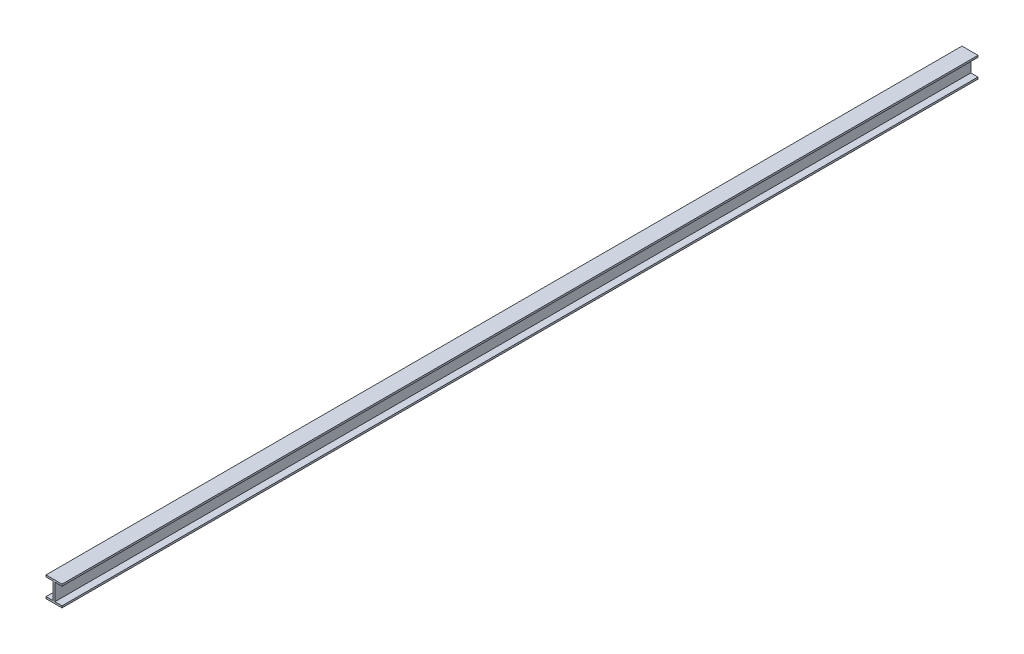
ISO-10303-21;
HEADER;
FILE_DESCRIPTION(('STEP AP214'),'2;1');
FILE_NAME('part.step','',(''),(''),'','','');
FILE_SCHEMA(('AUTOMOTIVE_DESIGN { 1 0 10303 214 1 1 1 1 }'));
ENDSEC;
DATA;
#1=APPLICATION_CONTEXT('core data for automotive mechanical design processes');
#2=APPLICATION_PROTOCOL_DEFINITION('international standard','automotive_design',2000,#1);
#3=PRODUCT_CONTEXT('',#1,'mechanical');
#4=PRODUCT('Part','Part','',(#3));
#5=PRODUCT_RELATED_PRODUCT_CATEGORY('part','',(#4));
#6=PRODUCT_DEFINITION_FORMATION('','',#4);
#7=PRODUCT_DEFINITION_CONTEXT('part definition',#1,'design');
#8=PRODUCT_DEFINITION('design','',#6,#7);
#9=PRODUCT_DEFINITION_SHAPE('','',#8);
#10=(LENGTH_UNIT() NAMED_UNIT(*) SI_UNIT(.MILLI.,.METRE.));
#11=(NAMED_UNIT(*) PLANE_ANGLE_UNIT() SI_UNIT($,.RADIAN.));
#12=(NAMED_UNIT(*) SI_UNIT($,.STERADIAN.) SOLID_ANGLE_UNIT());
#13=UNCERTAINTY_MEASURE_WITH_UNIT(LENGTH_MEASURE(1.E-05),#10,'distance_accuracy_value','');
#14=(GEOMETRIC_REPRESENTATION_CONTEXT(3) GLOBAL_UNCERTAINTY_ASSIGNED_CONTEXT((#13)) GLOBAL_UNIT_ASSIGNED_CONTEXT((#10,
#11,#12)) REPRESENTATION_CONTEXT('',''));
#15=CARTESIAN_POINT('',(0.,0.,0.));
#16=DIRECTION('',(0.,0.,1.));
#17=DIRECTION('',(1.,0.,0.));
#18=AXIS2_PLACEMENT_3D('',#15,#16,#17);
#19=CARTESIAN_POINT('',(0.,-328.,16000.));
#20=DIRECTION('',(0.,1.,0.));
#21=DIRECTION('',(0.,0.,1.));
#22=AXIS2_PLACEMENT_3D('',#19,#20,#21);
#23=PLANE('',#22);
#24=DIRECTION('',(1.,0.,0.));
#25=VECTOR('',#24,1.);
#26=CARTESIAN_POINT('',(0.,-328.,0.));
#27=LINE('',#26,#25);
#28=CARTESIAN_POINT('',(156.,-328.,0.));
#29=VERTEX_POINT('',#28);
#30=CARTESIAN_POINT('',(280.,-328.,0.));
#31=VERTEX_POINT('',#30);
#32=EDGE_CURVE('E164',#29,#31,#27,.T.);
#33=ORIENTED_EDGE('',*,*,#32,.F.);
#34=DIRECTION('',(0.,0.,-1.));
#35=VECTOR('',#34,1.);
#36=CARTESIAN_POINT('',(156.,-328.,16000.));
#37=LINE('',#36,#35);
#38=CARTESIAN_POINT('',(156.,-328.,16000.));
#39=VERTEX_POINT('',#38);
#40=EDGE_CURVE('E11',#39,#29,#37,.T.);
#41=ORIENTED_EDGE('',*,*,#40,.F.);
#42=DIRECTION('',(1.,0.,0.));
#43=VECTOR('',#42,1.);
#44=CARTESIAN_POINT('',(0.,-328.,16000.));
#45=LINE('',#44,#43);
#46=CARTESIAN_POINT('',(280.,-328.,16000.));
#47=VERTEX_POINT('',#46);
#48=EDGE_CURVE('E205',#39,#47,#45,.T.);
#49=ORIENTED_EDGE('',*,*,#48,.T.);
#50=DIRECTION('',(0.,0.,-1.));
#51=VECTOR('',#50,1.);
#52=CARTESIAN_POINT('',(280.,-328.,16000.));
#53=LINE('',#52,#51);
#54=EDGE_CURVE('E104',#47,#31,#53,.T.);
#55=ORIENTED_EDGE('',*,*,#54,.T.);
#56=EDGE_LOOP('',(#33,#41,#49,#55));
#57=FACE_BOUND('',#56,.T.);
#58=ADVANCED_FACE('F41',(#57),#23,.T.);
#59=CARTESIAN_POINT('',(156.,0.,16000.));
#60=DIRECTION('',(1.,0.,0.));
#61=DIRECTION('',(0.,1.,0.));
#62=AXIS2_PLACEMENT_3D('',#59,#60,#61);
#63=PLANE('',#62);
#64=DIRECTION('',(0.,-1.,0.));
#65=VECTOR('',#64,1.);
#66=CARTESIAN_POINT('',(156.,0.,0.));
#67=LINE('',#66,#65);
#68=CARTESIAN_POINT('',(156.,-32.,0.));
#69=VERTEX_POINT('',#68);
#70=EDGE_CURVE('E168',#69,#29,#67,.T.);
#71=ORIENTED_EDGE('',*,*,#70,.F.);
#72=DIRECTION('',(0.,0.,-1.));
#73=VECTOR('',#72,1.);
#74=CARTESIAN_POINT('',(156.,-32.,16000.));
#75=LINE('',#74,#73);
#76=CARTESIAN_POINT('',(156.,-32.,16000.));
#77=VERTEX_POINT('',#76);
#78=EDGE_CURVE('E50',#77,#69,#75,.T.);
#79=ORIENTED_EDGE('',*,*,#78,.F.);
#80=DIRECTION('',(0.,-1.,0.));
#81=VECTOR('',#80,1.);
#82=CARTESIAN_POINT('',(156.,0.,16000.));
#83=LINE('',#82,#81);
#84=EDGE_CURVE('E246',#77,#39,#83,.T.);
#85=ORIENTED_EDGE('',*,*,#84,.T.);
#86=ORIENTED_EDGE('',*,*,#40,.T.);
#87=EDGE_LOOP('',(#71,#79,#85,#86));
#88=FACE_BOUND('',#87,.T.);
#89=ADVANCED_FACE('F245',(#88),#63,.T.);
#90=CARTESIAN_POINT('',(0.,-32.,16000.));
#91=DIRECTION('',(0.,1.,0.));
#92=DIRECTION('',(-1.,0.,0.));
#93=AXIS2_PLACEMENT_3D('',#90,#91,#92);
#94=PLANE('',#93);
#95=DIRECTION('',(1.,0.,0.));
#96=VECTOR('',#95,1.);
#97=CARTESIAN_POINT('',(0.,-32.,0.));
#98=LINE('',#97,#96);
#99=CARTESIAN_POINT('',(280.,-32.,0.));
#100=VERTEX_POINT('',#99);
#101=EDGE_CURVE('E172',#69,#100,#98,.T.);
#102=ORIENTED_EDGE('',*,*,#101,.T.);
#103=DIRECTION('',(0.,0.,-1.));
#104=VECTOR('',#103,1.);
#105=CARTESIAN_POINT('',(280.,-32.,16000.));
#106=LINE('',#105,#104);
#107=CARTESIAN_POINT('',(280.,-32.,16000.));
#108=VERTEX_POINT('',#107);
#109=EDGE_CURVE('E229',#108,#100,#106,.T.);
#110=ORIENTED_EDGE('',*,*,#109,.F.);
#111=DIRECTION('',(1.,0.,0.));
#112=VECTOR('',#111,1.);
#113=CARTESIAN_POINT('',(0.,-32.,16000.));
#114=LINE('',#113,#112);
#115=EDGE_CURVE('E237',#77,#108,#114,.T.);
#116=ORIENTED_EDGE('',*,*,#115,.F.);
#117=ORIENTED_EDGE('',*,*,#78,.T.);
#118=EDGE_LOOP('',(#102,#110,#116,#117));
#119=FACE_BOUND('',#118,.T.);
#120=ADVANCED_FACE('F235',(#119),#94,.F.);
#121=CARTESIAN_POINT('',(280.,0.,16000.));
#122=DIRECTION('',(1.,0.,0.));
#123=DIRECTION('',(0.,0.,-1.));
#124=AXIS2_PLACEMENT_3D('',#121,#122,#123);
#125=PLANE('',#124);
#126=DIRECTION('',(0.,-1.,0.));
#127=VECTOR('',#126,1.);
#128=CARTESIAN_POINT('',(280.,0.,0.));
#129=LINE('',#128,#127);
#130=CARTESIAN_POINT('',(280.,0.,0.));
#131=VERTEX_POINT('',#130);
#132=EDGE_CURVE('E176',#131,#100,#129,.T.);
#133=ORIENTED_EDGE('',*,*,#132,.F.);
#134=DIRECTION('',(0.,0.,-1.));
#135=VECTOR('',#134,1.);
#136=CARTESIAN_POINT('',(280.,0.,16000.));
#137=LINE('',#136,#135);
#138=CARTESIAN_POINT('',(280.,0.,16000.));
#139=VERTEX_POINT('',#138);
#140=EDGE_CURVE('E226',#139,#131,#137,.T.);
#141=ORIENTED_EDGE('',*,*,#140,.F.);
#142=DIRECTION('',(0.,-1.,0.));
#143=VECTOR('',#142,1.);
#144=CARTESIAN_POINT('',(280.,0.,16000.));
#145=LINE('',#144,#143);
#146=EDGE_CURVE('E257',#139,#108,#145,.T.);
#147=ORIENTED_EDGE('',*,*,#146,.T.);
#148=ORIENTED_EDGE('',*,*,#109,.T.);
#149=EDGE_LOOP('',(#133,#141,#147,#148));
#150=FACE_BOUND('',#149,.T.);
#151=ADVANCED_FACE('F295',(#150),#125,.T.);
#152=CARTESIAN_POINT('',(0.,0.,16000.));
#153=DIRECTION('',(0.,1.,0.));
#154=DIRECTION('',(0.,0.,1.));
#155=AXIS2_PLACEMENT_3D('',#152,#153,#154);
#156=PLANE('',#155);
#157=DIRECTION('',(1.,0.,0.));
#158=VECTOR('',#157,1.);
#159=CARTESIAN_POINT('',(0.,0.,0.));
#160=LINE('',#159,#158);
#161=CARTESIAN_POINT('',(0.,0.,0.));
#162=VERTEX_POINT('',#161);
#163=EDGE_CURVE('E180',#162,#131,#160,.T.);
#164=ORIENTED_EDGE('',*,*,#163,.F.);
#165=DIRECTION('',(0.,0.,-1.));
#166=VECTOR('',#165,1.);
#167=CARTESIAN_POINT('',(0.,0.,16000.));
#168=LINE('',#167,#166);
#169=CARTESIAN_POINT('',(0.,0.,16000.));
#170=VERTEX_POINT('',#169);
#171=EDGE_CURVE('E223',#170,#162,#168,.T.);
#172=ORIENTED_EDGE('',*,*,#171,.F.);
#173=DIRECTION('',(1.,0.,0.));
#174=VECTOR('',#173,1.);
#175=CARTESIAN_POINT('',(0.,0.,16000.));
#176=LINE('',#175,#174);
#177=EDGE_CURVE('E261',#170,#139,#176,.T.);
#178=ORIENTED_EDGE('',*,*,#177,.T.);
#179=ORIENTED_EDGE('',*,*,#140,.T.);
#180=EDGE_LOOP('',(#164,#172,#178,#179));
#181=FACE_BOUND('',#180,.T.);
#182=ADVANCED_FACE('F292',(#181),#156,.T.);
#183=CARTESIAN_POINT('',(0.,0.,16000.));
#184=DIRECTION('',(1.,0.,0.));
#185=DIRECTION('',(0.,1.,0.));
#186=AXIS2_PLACEMENT_3D('',#183,#184,#185);
#187=PLANE('',#186);
#188=DIRECTION('',(0.,-1.,0.));
#189=VECTOR('',#188,1.);
#190=CARTESIAN_POINT('',(0.,0.,0.));
#191=LINE('',#190,#189);
#192=CARTESIAN_POINT('',(0.,-32.,0.));
#193=VERTEX_POINT('',#192);
#194=EDGE_CURVE('E184',#162,#193,#191,.T.);
#195=ORIENTED_EDGE('',*,*,#194,.T.);
#196=DIRECTION('',(0.,0.,-1.));
#197=VECTOR('',#196,1.);
#198=CARTESIAN_POINT('',(0.,-32.,16000.));
#199=LINE('',#198,#197);
#200=CARTESIAN_POINT('',(0.,-32.,16000.));
#201=VERTEX_POINT('',#200);
#202=EDGE_CURVE('E219',#201,#193,#199,.T.);
#203=ORIENTED_EDGE('',*,*,#202,.F.);
#204=DIRECTION('',(0.,-1.,0.));
#205=VECTOR('',#204,1.);
#206=CARTESIAN_POINT('',(0.,0.,16000.));
#207=LINE('',#206,#205);
#208=EDGE_CURVE('E265',#170,#201,#207,.T.);
#209=ORIENTED_EDGE('',*,*,#208,.F.);
#210=ORIENTED_EDGE('',*,*,#171,.T.);
#211=EDGE_LOOP('',(#195,#203,#209,#210));
#212=FACE_BOUND('',#211,.T.);
#213=ADVANCED_FACE('F289',(#212),#187,.F.);
#214=CARTESIAN_POINT('',(0.,-32.,16000.));
#215=DIRECTION('',(0.,1.,0.));
#216=DIRECTION('',(-1.,0.,0.));
#217=AXIS2_PLACEMENT_3D('',#214,#215,#216);
#218=PLANE('',#217);
#219=DIRECTION('',(1.,0.,0.));
#220=VECTOR('',#219,1.);
#221=CARTESIAN_POINT('',(0.,-32.,0.));
#222=LINE('',#221,#220);
#223=CARTESIAN_POINT('',(124.,-32.,0.));
#224=VERTEX_POINT('',#223);
#225=EDGE_CURVE('E187',#193,#224,#222,.T.);
#226=ORIENTED_EDGE('',*,*,#225,.T.);
#227=DIRECTION('',(0.,0.,-1.));
#228=VECTOR('',#227,1.);
#229=CARTESIAN_POINT('',(124.,-32.,16000.));
#230=LINE('',#229,#228);
#231=CARTESIAN_POINT('',(124.,-32.,16000.));
#232=VERTEX_POINT('',#231);
#233=EDGE_CURVE('E215',#232,#224,#230,.T.);
#234=ORIENTED_EDGE('',*,*,#233,.F.);
#235=DIRECTION('',(1.,0.,0.));
#236=VECTOR('',#235,1.);
#237=CARTESIAN_POINT('',(0.,-32.,16000.));
#238=LINE('',#237,#236);
#239=EDGE_CURVE('E268',#201,#232,#238,.T.);
#240=ORIENTED_EDGE('',*,*,#239,.F.);
#241=ORIENTED_EDGE('',*,*,#202,.T.);
#242=EDGE_LOOP('',(#226,#234,#240,#241));
#243=FACE_BOUND('',#242,.T.);
#244=ADVANCED_FACE('F285',(#243),#218,.F.);
#245=CARTESIAN_POINT('',(124.,0.,16000.));
#246=DIRECTION('',(1.,0.,0.));
#247=DIRECTION('',(0.,1.,0.));
#248=AXIS2_PLACEMENT_3D('',#245,#246,#247);
#249=PLANE('',#248);
#250=DIRECTION('',(0.,-1.,0.));
#251=VECTOR('',#250,1.);
#252=CARTESIAN_POINT('',(124.,0.,0.));
#253=LINE('',#252,#251);
#254=CARTESIAN_POINT('',(124.,-328.,0.));
#255=VERTEX_POINT('',#254);
#256=EDGE_CURVE('E190',#224,#255,#253,.T.);
#257=ORIENTED_EDGE('',*,*,#256,.T.);
#258=DIRECTION('',(0.,0.,-1.));
#259=VECTOR('',#258,1.);
#260=CARTESIAN_POINT('',(124.,-328.,16000.));
#261=LINE('',#260,#259);
#262=CARTESIAN_POINT('',(124.,-328.,16000.));
#263=VERTEX_POINT('',#262);
#264=EDGE_CURVE('E212',#263,#255,#261,.T.);
#265=ORIENTED_EDGE('',*,*,#264,.F.);
#266=DIRECTION('',(0.,-1.,0.));
#267=VECTOR('',#266,1.);
#268=CARTESIAN_POINT('',(124.,0.,16000.));
#269=LINE('',#268,#267);
#270=EDGE_CURVE('E158',#232,#263,#269,.T.);
#271=ORIENTED_EDGE('',*,*,#270,.F.);
#272=ORIENTED_EDGE('',*,*,#233,.T.);
#273=EDGE_LOOP('',(#257,#265,#271,#272));
#274=FACE_BOUND('',#273,.T.);
#275=ADVANCED_FACE('F276',(#274),#249,.F.);
#276=CARTESIAN_POINT('',(0.,-328.,16000.));
#277=DIRECTION('',(0.,1.,0.));
#278=DIRECTION('',(0.,0.,1.));
#279=AXIS2_PLACEMENT_3D('',#276,#277,#278);
#280=PLANE('',#279);
#281=DIRECTION('',(1.,0.,0.));
#282=VECTOR('',#281,1.);
#283=CARTESIAN_POINT('',(0.,-328.,0.));
#284=LINE('',#283,#282);
#285=CARTESIAN_POINT('',(0.,-328.,0.));
#286=VERTEX_POINT('',#285);
#287=EDGE_CURVE('E194',#286,#255,#284,.T.);
#288=ORIENTED_EDGE('',*,*,#287,.F.);
#289=DIRECTION('',(0.,0.,-1.));
#290=VECTOR('',#289,1.);
#291=CARTESIAN_POINT('',(0.,-328.,16000.));
#292=LINE('',#291,#290);
#293=CARTESIAN_POINT('',(0.,-328.,16000.));
#294=VERTEX_POINT('',#293);
#295=EDGE_CURVE('E144',#294,#286,#292,.T.);
#296=ORIENTED_EDGE('',*,*,#295,.F.);
#297=DIRECTION('',(1.,0.,0.));
#298=VECTOR('',#297,1.);
#299=CARTESIAN_POINT('',(0.,-328.,16000.));
#300=LINE('',#299,#298);
#301=EDGE_CURVE('E154',#294,#263,#300,.T.);
#302=ORIENTED_EDGE('',*,*,#301,.T.);
#303=ORIENTED_EDGE('',*,*,#264,.T.);
#304=EDGE_LOOP('',(#288,#296,#302,#303));
#305=FACE_BOUND('',#304,.T.);
#306=ADVANCED_FACE('F280',(#305),#280,.T.);
#307=CARTESIAN_POINT('',(0.,0.,16000.));
#308=DIRECTION('',(-1.,0.,0.));
#309=DIRECTION('',(0.,0.,1.));
#310=AXIS2_PLACEMENT_3D('',#307,#308,#309);
#311=PLANE('',#310);
#312=DIRECTION('',(0.,1.,0.));
#313=VECTOR('',#312,1.);
#314=CARTESIAN_POINT('',(0.,0.,0.));
#315=LINE('',#314,#313);
#316=CARTESIAN_POINT('',(0.,-360.,0.));
#317=VERTEX_POINT('',#316);
#318=EDGE_CURVE('E142',#317,#286,#315,.T.);
#319=ORIENTED_EDGE('',*,*,#318,.F.);
#320=DIRECTION('',(0.,0.,-1.));
#321=VECTOR('',#320,1.);
#322=CARTESIAN_POINT('',(0.,-360.,16000.));
#323=LINE('',#322,#321);
#324=CARTESIAN_POINT('',(0.,-360.,16000.));
#325=VERTEX_POINT('',#324);
#326=EDGE_CURVE('E136',#325,#317,#323,.T.);
#327=ORIENTED_EDGE('',*,*,#326,.F.);
#328=DIRECTION('',(0.,1.,0.));
#329=VECTOR('',#328,1.);
#330=CARTESIAN_POINT('',(0.,0.,16000.));
#331=LINE('',#330,#329);
#332=EDGE_CURVE('E140',#325,#294,#331,.T.);
#333=ORIENTED_EDGE('',*,*,#332,.T.);
#334=ORIENTED_EDGE('',*,*,#295,.T.);
#335=EDGE_LOOP('',(#319,#327,#333,#334));
#336=FACE_BOUND('',#335,.T.);
#337=ADVANCED_FACE('F138',(#336),#311,.T.);
#338=CARTESIAN_POINT('',(0.,-360.,16000.));
#339=DIRECTION('',(0.,1.,0.));
#340=DIRECTION('',(0.,0.,1.));
#341=AXIS2_PLACEMENT_3D('',#338,#339,#340);
#342=PLANE('',#341);
#343=DIRECTION('',(1.,0.,0.));
#344=VECTOR('',#343,1.);
#345=CARTESIAN_POINT('',(0.,-360.,0.));
#346=LINE('',#345,#344);
#347=CARTESIAN_POINT('',(280.,-360.,0.));
#348=VERTEX_POINT('',#347);
#349=EDGE_CURVE('E97',#317,#348,#346,.T.);
#350=ORIENTED_EDGE('',*,*,#349,.T.);
#351=DIRECTION('',(0.,0.,-1.));
#352=VECTOR('',#351,1.);
#353=CARTESIAN_POINT('',(280.,-360.,16000.));
#354=LINE('',#353,#352);
#355=CARTESIAN_POINT('',(280.,-360.,16000.));
#356=VERTEX_POINT('',#355);
#357=EDGE_CURVE('E145',#356,#348,#354,.T.);
#358=ORIENTED_EDGE('',*,*,#357,.F.);
#359=DIRECTION('',(1.,0.,0.));
#360=VECTOR('',#359,1.);
#361=CARTESIAN_POINT('',(0.,-360.,16000.));
#362=LINE('',#361,#360);
#363=EDGE_CURVE('E147',#325,#356,#362,.T.);
#364=ORIENTED_EDGE('',*,*,#363,.F.);
#365=ORIENTED_EDGE('',*,*,#326,.T.);
#366=EDGE_LOOP('',(#350,#358,#364,#365));
#367=FACE_BOUND('',#366,.T.);
#368=ADVANCED_FACE('F148',(#367),#342,.F.);
#369=CARTESIAN_POINT('',(280.,0.,16000.));
#370=DIRECTION('',(-1.,0.,0.));
#371=DIRECTION('',(0.,0.,1.));
#372=AXIS2_PLACEMENT_3D('',#369,#370,#371);
#373=PLANE('',#372);
#374=DIRECTION('',(0.,1.,0.));
#375=VECTOR('',#374,1.);
#376=CARTESIAN_POINT('',(280.,0.,0.));
#377=LINE('',#376,#375);
#378=EDGE_CURVE('E202',#348,#31,#377,.T.);
#379=ORIENTED_EDGE('',*,*,#378,.T.);
#380=ORIENTED_EDGE('',*,*,#54,.F.);
#381=DIRECTION('',(0.,1.,0.));
#382=VECTOR('',#381,1.);
#383=CARTESIAN_POINT('',(280.,0.,16000.));
#384=LINE('',#383,#382);
#385=EDGE_CURVE('E58',#356,#47,#384,.T.);
#386=ORIENTED_EDGE('',*,*,#385,.F.);
#387=ORIENTED_EDGE('',*,*,#357,.T.);
#388=EDGE_LOOP('',(#379,#380,#386,#387));
#389=FACE_BOUND('',#388,.T.);
#390=ADVANCED_FACE('F249',(#389),#373,.F.);
#391=CARTESIAN_POINT('',(0.,0.,16000.));
#392=DIRECTION('',(0.,0.,1.));
#393=DIRECTION('',(1.,0.,0.));
#394=AXIS2_PLACEMENT_3D('',#391,#392,#393);
#395=PLANE('',#394);
#396=ORIENTED_EDGE('',*,*,#48,.F.);
#397=ORIENTED_EDGE('',*,*,#84,.F.);
#398=ORIENTED_EDGE('',*,*,#115,.T.);
#399=ORIENTED_EDGE('',*,*,#146,.F.);
#400=ORIENTED_EDGE('',*,*,#177,.F.);
#401=ORIENTED_EDGE('',*,*,#208,.T.);
#402=ORIENTED_EDGE('',*,*,#239,.T.);
#403=ORIENTED_EDGE('',*,*,#270,.T.);
#404=ORIENTED_EDGE('',*,*,#301,.F.);
#405=ORIENTED_EDGE('',*,*,#332,.F.);
#406=ORIENTED_EDGE('',*,*,#363,.T.);
#407=ORIENTED_EDGE('',*,*,#385,.T.);
#408=EDGE_LOOP('',(#396,#397,#398,#399,#400,#401,#402,#403,#404,#405,#406,#407));
#409=FACE_BOUND('',#408,.T.);
#410=ADVANCED_FACE('F152',(#409),#395,.T.);
#411=CARTESIAN_POINT('',(0.,0.,0.));
#412=DIRECTION('',(0.,0.,1.));
#413=DIRECTION('',(1.,0.,0.));
#414=AXIS2_PLACEMENT_3D('',#411,#412,#413);
#415=PLANE('',#414);
#416=ORIENTED_EDGE('',*,*,#32,.T.);
#417=ORIENTED_EDGE('',*,*,#378,.F.);
#418=ORIENTED_EDGE('',*,*,#349,.F.);
#419=ORIENTED_EDGE('',*,*,#318,.T.);
#420=ORIENTED_EDGE('',*,*,#287,.T.);
#421=ORIENTED_EDGE('',*,*,#256,.F.);
#422=ORIENTED_EDGE('',*,*,#225,.F.);
#423=ORIENTED_EDGE('',*,*,#194,.F.);
#424=ORIENTED_EDGE('',*,*,#163,.T.);
#425=ORIENTED_EDGE('',*,*,#132,.T.);
#426=ORIENTED_EDGE('',*,*,#101,.F.);
#427=ORIENTED_EDGE('',*,*,#70,.T.);
#428=EDGE_LOOP('',(#416,#417,#418,#419,#420,#421,#422,#423,#424,#425,#426,#427));
#429=FACE_BOUND('',#428,.T.);
#430=ADVANCED_FACE('F243',(#429),#415,.F.);
#431=CLOSED_SHELL('',(#58,#89,#120,#151,#182,#213,#244,#275,#306,#337,#368,#390,#410,#430));
#432=MANIFOLD_SOLID_BREP('B2',#431);
#433=ADVANCED_BREP_SHAPE_REPRESENTATION('',(#18,#432),#14);
#434=SHAPE_DEFINITION_REPRESENTATION(#9,#433);
ENDSEC;
END-ISO-10303-21;
